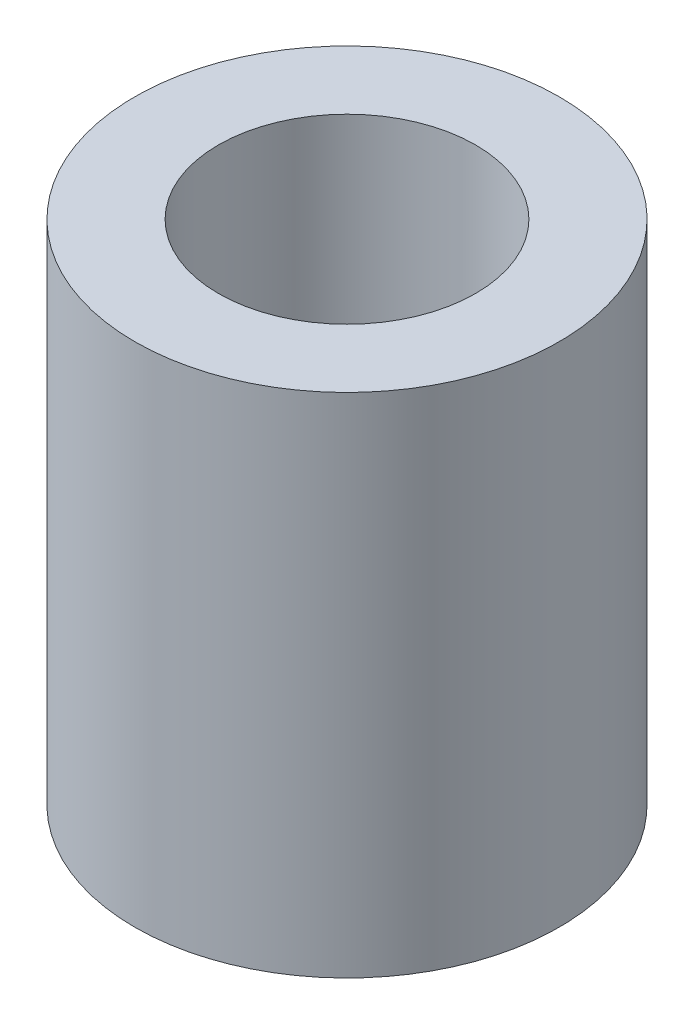
ISO-10303-21;
HEADER;
FILE_DESCRIPTION(('STEP AP214'),'2;1');
FILE_NAME('part.step','',(''),(''),'','','');
FILE_SCHEMA(('AUTOMOTIVE_DESIGN { 1 0 10303 214 1 1 1 1 }'));
ENDSEC;
DATA;
#1=APPLICATION_CONTEXT('core data for automotive mechanical design processes');
#2=APPLICATION_PROTOCOL_DEFINITION('international standard','automotive_design',2000,#1);
#3=PRODUCT_CONTEXT('',#1,'mechanical');
#4=PRODUCT('Part','Part','',(#3));
#5=PRODUCT_RELATED_PRODUCT_CATEGORY('part','',(#4));
#6=PRODUCT_DEFINITION_FORMATION('','',#4);
#7=PRODUCT_DEFINITION_CONTEXT('part definition',#1,'design');
#8=PRODUCT_DEFINITION('design','',#6,#7);
#9=PRODUCT_DEFINITION_SHAPE('','',#8);
#10=(LENGTH_UNIT() NAMED_UNIT(*) SI_UNIT(.MILLI.,.METRE.));
#11=(NAMED_UNIT(*) PLANE_ANGLE_UNIT() SI_UNIT($,.RADIAN.));
#12=(NAMED_UNIT(*) SI_UNIT($,.STERADIAN.) SOLID_ANGLE_UNIT());
#13=UNCERTAINTY_MEASURE_WITH_UNIT(LENGTH_MEASURE(1.E-05),#10,'distance_accuracy_value','');
#14=(GEOMETRIC_REPRESENTATION_CONTEXT(3) GLOBAL_UNCERTAINTY_ASSIGNED_CONTEXT((#13)) GLOBAL_UNIT_ASSIGNED_CONTEXT((#10,
#11,#12)) REPRESENTATION_CONTEXT('',''));
#15=CARTESIAN_POINT('',(0.,0.,0.));
#16=DIRECTION('',(0.,0.,1.));
#17=DIRECTION('',(1.,0.,0.));
#18=AXIS2_PLACEMENT_3D('',#15,#16,#17);
#19=CARTESIAN_POINT('',(0.,9.49999999999999,0.));
#20=DIRECTION('',(0.,-1.,0.));
#21=DIRECTION('',(0.,0.,-1.));
#22=AXIS2_PLACEMENT_3D('',#19,#20,#21);
#23=CYLINDRICAL_SURFACE('',#22,3.975);
#24=CARTESIAN_POINT('',(0.,9.49999999999999,0.));
#25=DIRECTION('',(0.,1.,0.));
#26=DIRECTION('',(0.,0.,1.));
#27=AXIS2_PLACEMENT_3D('',#24,#25,#26);
#28=CIRCLE('',#27,3.975);
#29=CARTESIAN_POINT('',(0.,9.49999999999999,3.975));
#30=VERTEX_POINT('',#29);
#31=EDGE_CURVE('E12',#30,#30,#28,.T.);
#32=ORIENTED_EDGE('',*,*,#31,.F.);
#33=EDGE_LOOP('',(#32));
#34=FACE_BOUND('',#33,.T.);
#35=CARTESIAN_POINT('',(0.,0.,0.));
#36=DIRECTION('',(0.,1.,0.));
#37=DIRECTION('',(0.,0.,1.));
#38=AXIS2_PLACEMENT_3D('',#35,#36,#37);
#39=CIRCLE('',#38,3.975);
#40=CARTESIAN_POINT('',(0.,0.,3.975));
#41=VERTEX_POINT('',#40);
#42=EDGE_CURVE('E47',#41,#41,#39,.T.);
#43=ORIENTED_EDGE('',*,*,#42,.T.);
#44=EDGE_LOOP('',(#43));
#45=FACE_BOUND('',#44,.T.);
#46=ADVANCED_FACE('F44',(#34,#45),#23,.T.);
#47=CARTESIAN_POINT('',(0.,9.49999999999999,0.));
#48=DIRECTION('',(0.,1.,0.));
#49=DIRECTION('',(0.,0.,1.));
#50=AXIS2_PLACEMENT_3D('',#47,#48,#49);
#51=PLANE('',#50);
#52=CARTESIAN_POINT('',(0.,9.49999999999999,0.));
#53=DIRECTION('',(0.,1.,0.));
#54=DIRECTION('',(0.,0.,1.));
#55=AXIS2_PLACEMENT_3D('',#52,#53,#54);
#56=CIRCLE('',#55,2.41);
#57=CARTESIAN_POINT('',(0.,9.49999999999999,2.41));
#58=VERTEX_POINT('',#57);
#59=EDGE_CURVE('E56',#58,#58,#56,.T.);
#60=ORIENTED_EDGE('',*,*,#59,.F.);
#61=EDGE_LOOP('',(#60));
#62=FACE_BOUND('',#61,.T.);
#63=ORIENTED_EDGE('',*,*,#31,.T.);
#64=EDGE_LOOP('',(#63));
#65=FACE_BOUND('',#64,.T.);
#66=ADVANCED_FACE('F71',(#62,#65),#51,.T.);
#67=CARTESIAN_POINT('',(0.,0.,0.));
#68=DIRECTION('',(0.,1.,0.));
#69=DIRECTION('',(0.,0.,1.));
#70=AXIS2_PLACEMENT_3D('',#67,#68,#69);
#71=PLANE('',#70);
#72=CARTESIAN_POINT('',(0.,0.,0.));
#73=DIRECTION('',(0.,1.,0.));
#74=DIRECTION('',(0.,0.,1.));
#75=AXIS2_PLACEMENT_3D('',#72,#73,#74);
#76=CIRCLE('',#75,2.41);
#77=CARTESIAN_POINT('',(0.,0.,2.41));
#78=VERTEX_POINT('',#77);
#79=EDGE_CURVE('E54',#78,#78,#76,.T.);
#80=ORIENTED_EDGE('',*,*,#79,.T.);
#81=EDGE_LOOP('',(#80));
#82=FACE_BOUND('',#81,.T.);
#83=ORIENTED_EDGE('',*,*,#42,.F.);
#84=EDGE_LOOP('',(#83));
#85=FACE_BOUND('',#84,.T.);
#86=ADVANCED_FACE('F62',(#82,#85),#71,.F.);
#87=CARTESIAN_POINT('',(0.,0.,0.));
#88=DIRECTION('',(0.,1.,0.));
#89=DIRECTION('',(0.,0.,1.));
#90=AXIS2_PLACEMENT_3D('',#87,#88,#89);
#91=CYLINDRICAL_SURFACE('',#90,2.41);
#92=ORIENTED_EDGE('',*,*,#79,.F.);
#93=EDGE_LOOP('',(#92));
#94=FACE_BOUND('',#93,.T.);
#95=ORIENTED_EDGE('',*,*,#59,.T.);
#96=EDGE_LOOP('',(#95));
#97=FACE_BOUND('',#96,.T.);
#98=ADVANCED_FACE('F65',(#94,#97),#91,.F.);
#99=CLOSED_SHELL('',(#46,#66,#86,#98));
#100=MANIFOLD_SOLID_BREP('B2',#99);
#101=ADVANCED_BREP_SHAPE_REPRESENTATION('',(#18,#100),#14);
#102=SHAPE_DEFINITION_REPRESENTATION(#9,#101);
ENDSEC;
END-ISO-10303-21;
